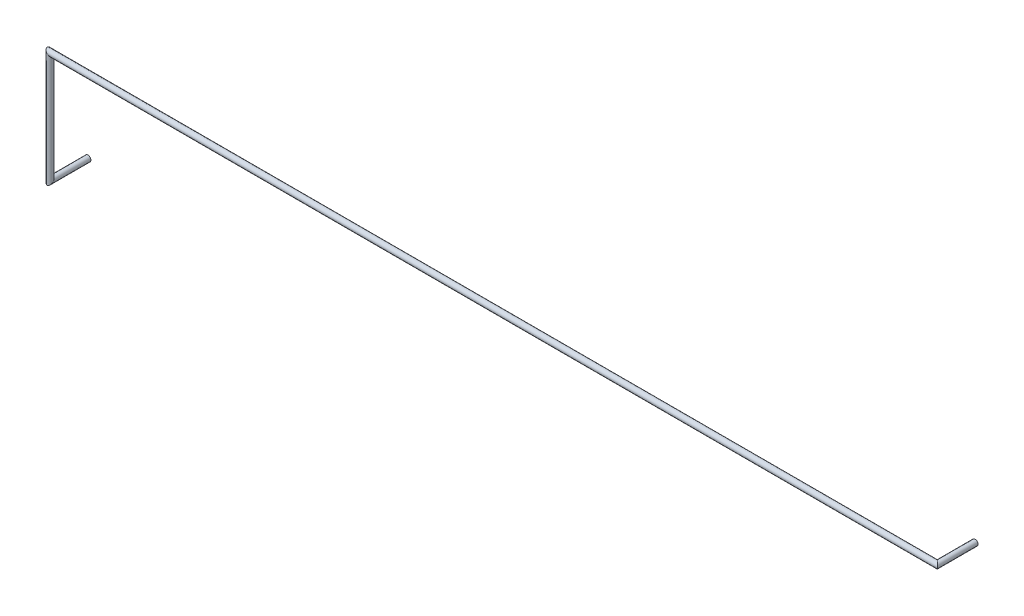
ISO-10303-21;
HEADER;
FILE_DESCRIPTION(('STEP AP214'),'2;1');
FILE_NAME('part.step','',(''),(''),'','','');
FILE_SCHEMA(('AUTOMOTIVE_DESIGN { 1 0 10303 214 1 1 1 1 }'));
ENDSEC;
DATA;
#1=APPLICATION_CONTEXT('core data for automotive mechanical design processes');
#2=APPLICATION_PROTOCOL_DEFINITION('international standard','automotive_design',2000,#1);
#3=PRODUCT_CONTEXT('',#1,'mechanical');
#4=PRODUCT('Part','Part','',(#3));
#5=PRODUCT_RELATED_PRODUCT_CATEGORY('part','',(#4));
#6=PRODUCT_DEFINITION_FORMATION('','',#4);
#7=PRODUCT_DEFINITION_CONTEXT('part definition',#1,'design');
#8=PRODUCT_DEFINITION('design','',#6,#7);
#9=PRODUCT_DEFINITION_SHAPE('','',#8);
#10=(LENGTH_UNIT() NAMED_UNIT(*) SI_UNIT(.MILLI.,.METRE.));
#11=(NAMED_UNIT(*) PLANE_ANGLE_UNIT() SI_UNIT($,.RADIAN.));
#12=(NAMED_UNIT(*) SI_UNIT($,.STERADIAN.) SOLID_ANGLE_UNIT());
#13=UNCERTAINTY_MEASURE_WITH_UNIT(LENGTH_MEASURE(1.E-05),#10,'distance_accuracy_value','');
#14=(GEOMETRIC_REPRESENTATION_CONTEXT(3) GLOBAL_UNCERTAINTY_ASSIGNED_CONTEXT((#13)) GLOBAL_UNIT_ASSIGNED_CONTEXT((#10,
#11,#12)) REPRESENTATION_CONTEXT('',''));
#15=CARTESIAN_POINT('',(0.,0.,0.));
#16=DIRECTION('',(0.,0.,1.));
#17=DIRECTION('',(1.,0.,0.));
#18=AXIS2_PLACEMENT_3D('',#15,#16,#17);
#19=CARTESIAN_POINT('',(60.96,7.62,0.));
#20=DIRECTION('',(0.,0.,1.));
#21=DIRECTION('',(1.,0.,0.));
#22=AXIS2_PLACEMENT_3D('',#19,#20,#21);
#23=PLANE('',#22);
#24=CARTESIAN_POINT('',(60.96,7.62,0.));
#25=DIRECTION('',(0.,0.,1.));
#26=DIRECTION('',(1.,0.,0.));
#27=AXIS2_PLACEMENT_3D('',#24,#25,#26);
#28=CIRCLE('',#27,0.199999999999999);
#29=CARTESIAN_POINT('',(61.16,7.62,0.));
#30=VERTEX_POINT('',#29);
#31=EDGE_CURVE('E52',#30,#30,#28,.T.);
#32=ORIENTED_EDGE('',*,*,#31,.F.);
#33=EDGE_LOOP('',(#32));
#34=FACE_BOUND('',#33,.T.);
#35=ADVANCED_FACE('F49',(#34),#23,.F.);
#36=CARTESIAN_POINT('',(0.,0.,0.));
#37=DIRECTION('',(0.,0.,-1.));
#38=DIRECTION('',(0.,-1.,0.));
#39=AXIS2_PLACEMENT_3D('',#36,#37,#38);
#40=PLANE('',#39);
#41=CARTESIAN_POINT('',(0.,0.,0.));
#42=DIRECTION('',(0.,0.,-1.));
#43=DIRECTION('',(0.,-1.,0.));
#44=AXIS2_PLACEMENT_3D('',#41,#42,#43);
#45=CIRCLE('',#44,0.199999999999999);
#46=CARTESIAN_POINT('',(0.,-0.199999999999999,0.));
#47=VERTEX_POINT('',#46);
#48=EDGE_CURVE('E57',#47,#47,#45,.T.);
#49=ORIENTED_EDGE('',*,*,#48,.T.);
#50=EDGE_LOOP('',(#49));
#51=FACE_BOUND('',#50,.T.);
#52=ADVANCED_FACE('F80',(#51),#40,.T.);
#53=CARTESIAN_POINT('',(60.96,7.62,2.92));
#54=DIRECTION('',(0.,0.,-1.));
#55=DIRECTION('',(-1.,0.,0.));
#56=AXIS2_PLACEMENT_3D('',#53,#54,#55);
#57=CYLINDRICAL_SURFACE('',#56,0.199999999999999);
#58=CARTESIAN_POINT('',(60.96,7.62,2.6));
#59=DIRECTION('',(0.707106781186548,0.,-0.707106781186548));
#60=DIRECTION('',(0.707106781186548,0.,0.707106781186548));
#61=AXIS2_PLACEMENT_3D('',#58,#59,#60);
#62=ELLIPSE('',#61,0.282842712474617,0.199999999999999);
#63=CARTESIAN_POINT('',(61.16,7.62,2.8));
#64=VERTEX_POINT('',#63);
#65=EDGE_CURVE('E68',#64,#64,#62,.T.);
#66=ORIENTED_EDGE('',*,*,#65,.T.);
#67=EDGE_LOOP('',(#66));
#68=FACE_BOUND('',#67,.T.);
#69=ORIENTED_EDGE('',*,*,#31,.T.);
#70=EDGE_LOOP('',(#69));
#71=FACE_BOUND('',#70,.T.);
#72=ADVANCED_FACE('F77',(#68,#71),#57,.T.);
#73=CARTESIAN_POINT('',(-0.539999999999997,7.62,2.6));
#74=DIRECTION('',(1.,0.,0.));
#75=DIRECTION('',(0.,0.,-1.));
#76=AXIS2_PLACEMENT_3D('',#73,#74,#75);
#77=CYLINDRICAL_SURFACE('',#76,0.199999999999999);
#78=CARTESIAN_POINT('',(0.,7.62,2.6));
#79=DIRECTION('',(0.707106781186548,0.707106781186548,0.));
#80=DIRECTION('',(-0.707106781186548,0.707106781186548,0.));
#81=AXIS2_PLACEMENT_3D('',#78,#79,#80);
#82=ELLIPSE('',#81,0.282842712474617,0.199999999999999);
#83=CARTESIAN_POINT('',(-0.199999999999999,7.82,2.6));
#84=VERTEX_POINT('',#83);
#85=EDGE_CURVE('E63',#84,#84,#82,.T.);
#86=ORIENTED_EDGE('',*,*,#85,.T.);
#87=EDGE_LOOP('',(#86));
#88=FACE_BOUND('',#87,.T.);
#89=ORIENTED_EDGE('',*,*,#65,.F.);
#90=EDGE_LOOP('',(#89));
#91=FACE_BOUND('',#90,.T.);
#92=ADVANCED_FACE('F93',(#88,#91),#77,.T.);
#93=CARTESIAN_POINT('',(0.,-0.319999999999996,2.6));
#94=DIRECTION('',(0.,1.,0.));
#95=DIRECTION('',(0.,0.,1.));
#96=AXIS2_PLACEMENT_3D('',#93,#94,#95);
#97=CYLINDRICAL_SURFACE('',#96,0.199999999999999);
#98=CARTESIAN_POINT('',(0.,0.,2.6));
#99=DIRECTION('',(0.,0.707106781186548,0.707106781186548));
#100=DIRECTION('',(0.,-0.707106781186548,0.707106781186548));
#101=AXIS2_PLACEMENT_3D('',#98,#99,#100);
#102=ELLIPSE('',#101,0.282842712474617,0.199999999999999);
#103=CARTESIAN_POINT('',(0.,-0.199999999999999,2.8));
#104=VERTEX_POINT('',#103);
#105=EDGE_CURVE('E11',#104,#104,#102,.T.);
#106=ORIENTED_EDGE('',*,*,#105,.T.);
#107=EDGE_LOOP('',(#106));
#108=FACE_BOUND('',#107,.T.);
#109=ORIENTED_EDGE('',*,*,#85,.F.);
#110=EDGE_LOOP('',(#109));
#111=FACE_BOUND('',#110,.T.);
#112=ADVANCED_FACE('F87',(#108,#111),#97,.T.);
#113=CARTESIAN_POINT('',(0.,0.,0.));
#114=DIRECTION('',(0.,0.,1.));
#115=DIRECTION('',(1.,0.,0.));
#116=AXIS2_PLACEMENT_3D('',#113,#114,#115);
#117=CYLINDRICAL_SURFACE('',#116,0.199999999999999);
#118=ORIENTED_EDGE('',*,*,#48,.F.);
#119=EDGE_LOOP('',(#118));
#120=FACE_BOUND('',#119,.T.);
#121=ORIENTED_EDGE('',*,*,#105,.F.);
#122=EDGE_LOOP('',(#121));
#123=FACE_BOUND('',#122,.T.);
#124=ADVANCED_FACE('F85',(#120,#123),#117,.T.);
#125=CLOSED_SHELL('',(#35,#52,#72,#92,#112,#124));
#126=MANIFOLD_SOLID_BREP('B2',#125);
#127=ADVANCED_BREP_SHAPE_REPRESENTATION('',(#18,#126),#14);
#128=SHAPE_DEFINITION_REPRESENTATION(#9,#127);
ENDSEC;
END-ISO-10303-21;
